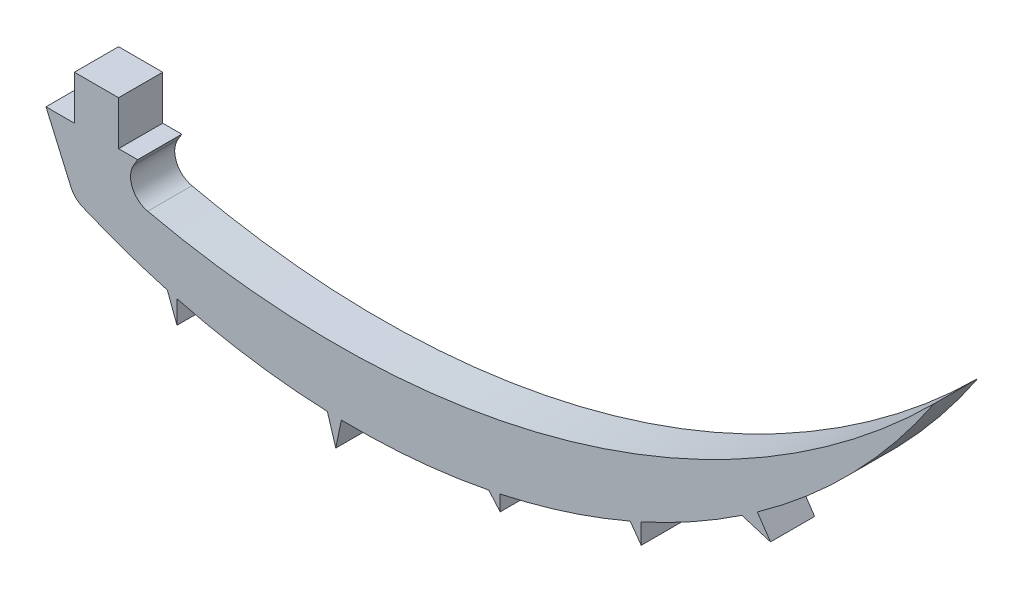
ISO-10303-21;
HEADER;
FILE_DESCRIPTION(('STEP AP214'),'2;1');
FILE_NAME('part.step','',(''),(''),'','','');
FILE_SCHEMA(('AUTOMOTIVE_DESIGN { 1 0 10303 214 1 1 1 1 }'));
ENDSEC;
DATA;
#1=APPLICATION_CONTEXT('core data for automotive mechanical design processes');
#2=APPLICATION_PROTOCOL_DEFINITION('international standard','automotive_design',2000,#1);
#3=PRODUCT_CONTEXT('',#1,'mechanical');
#4=PRODUCT('Part','Part','',(#3));
#5=PRODUCT_RELATED_PRODUCT_CATEGORY('part','',(#4));
#6=PRODUCT_DEFINITION_FORMATION('','',#4);
#7=PRODUCT_DEFINITION_CONTEXT('part definition',#1,'design');
#8=PRODUCT_DEFINITION('design','',#6,#7);
#9=PRODUCT_DEFINITION_SHAPE('','',#8);
#10=(LENGTH_UNIT() NAMED_UNIT(*) SI_UNIT(.MILLI.,.METRE.));
#11=(NAMED_UNIT(*) PLANE_ANGLE_UNIT() SI_UNIT($,.RADIAN.));
#12=(NAMED_UNIT(*) SI_UNIT($,.STERADIAN.) SOLID_ANGLE_UNIT());
#13=UNCERTAINTY_MEASURE_WITH_UNIT(LENGTH_MEASURE(1.E-05),#10,'distance_accuracy_value','');
#14=(GEOMETRIC_REPRESENTATION_CONTEXT(3) GLOBAL_UNCERTAINTY_ASSIGNED_CONTEXT((#13)) GLOBAL_UNIT_ASSIGNED_CONTEXT((#10,
#11,#12)) REPRESENTATION_CONTEXT('',''));
#15=CARTESIAN_POINT('',(0.,0.,0.));
#16=DIRECTION('',(0.,0.,1.));
#17=DIRECTION('',(1.,0.,0.));
#18=AXIS2_PLACEMENT_3D('',#15,#16,#17);
#19=CARTESIAN_POINT('',(6.43346433848039,1.52399999999999,1.524));
#20=DIRECTION('',(-1.,0.,0.));
#21=DIRECTION('',(0.,0.,1.));
#22=AXIS2_PLACEMENT_3D('',#19,#20,#21);
#23=PLANE('',#22);
#24=DIRECTION('',(0.,1.,0.));
#25=VECTOR('',#24,1.);
#26=CARTESIAN_POINT('',(6.43346433848039,1.52399999999999,0.));
#27=LINE('',#26,#25);
#28=CARTESIAN_POINT('',(6.43346433848039,0.,0.));
#29=VERTEX_POINT('',#28);
#30=CARTESIAN_POINT('',(6.43346433848039,1.52399999999999,0.));
#31=VERTEX_POINT('',#30);
#32=EDGE_CURVE('E228',#29,#31,#27,.T.);
#33=ORIENTED_EDGE('',*,*,#32,.T.);
#34=DIRECTION('',(0.,0.,-1.));
#35=VECTOR('',#34,1.);
#36=CARTESIAN_POINT('',(6.43346433848039,1.52399999999999,1.524));
#37=LINE('',#36,#35);
#38=CARTESIAN_POINT('',(6.43346433848039,1.52399999999999,1.524));
#39=VERTEX_POINT('',#38);
#40=EDGE_CURVE('E209',#39,#31,#37,.T.);
#41=ORIENTED_EDGE('',*,*,#40,.F.);
#42=DIRECTION('',(0.,1.,0.));
#43=VECTOR('',#42,1.);
#44=CARTESIAN_POINT('',(6.43346433848039,1.52399999999999,1.524));
#45=LINE('',#44,#43);
#46=CARTESIAN_POINT('',(6.43346433848039,0.,1.524));
#47=VERTEX_POINT('',#46);
#48=EDGE_CURVE('E216',#47,#39,#45,.T.);
#49=ORIENTED_EDGE('',*,*,#48,.F.);
#50=DIRECTION('',(0.,0.,-1.));
#51=VECTOR('',#50,1.);
#52=CARTESIAN_POINT('',(6.43346433848039,0.,1.524));
#53=LINE('',#52,#51);
#54=EDGE_CURVE('E301',#47,#29,#53,.T.);
#55=ORIENTED_EDGE('',*,*,#54,.T.);
#56=EDGE_LOOP('',(#33,#41,#49,#55));
#57=FACE_BOUND('',#56,.T.);
#58=ADVANCED_FACE('F32',(#57),#23,.F.);
#59=CARTESIAN_POINT('',(6.43346433848039,1.52399999999999,1.524));
#60=DIRECTION('',(0.,-1.,0.));
#61=DIRECTION('',(1.,0.,0.));
#62=AXIS2_PLACEMENT_3D('',#59,#60,#61);
#63=PLANE('',#62);
#64=DIRECTION('',(-1.,0.,0.));
#65=VECTOR('',#64,1.);
#66=CARTESIAN_POINT('',(6.43346433848039,1.52399999999999,0.));
#67=LINE('',#66,#65);
#68=CARTESIAN_POINT('',(4.90946433848039,1.52399999999999,0.));
#69=VERTEX_POINT('',#68);
#70=EDGE_CURVE('E366',#31,#69,#67,.T.);
#71=ORIENTED_EDGE('',*,*,#70,.T.);
#72=DIRECTION('',(0.,0.,-1.));
#73=VECTOR('',#72,1.);
#74=CARTESIAN_POINT('',(4.90946433848039,1.52399999999999,1.524));
#75=LINE('',#74,#73);
#76=CARTESIAN_POINT('',(4.90946433848039,1.52399999999999,1.524));
#77=VERTEX_POINT('',#76);
#78=EDGE_CURVE('E212',#77,#69,#75,.T.);
#79=ORIENTED_EDGE('',*,*,#78,.F.);
#80=DIRECTION('',(-1.,0.,0.));
#81=VECTOR('',#80,1.);
#82=CARTESIAN_POINT('',(6.43346433848039,1.52399999999999,1.524));
#83=LINE('',#82,#81);
#84=EDGE_CURVE('E205',#39,#77,#83,.T.);
#85=ORIENTED_EDGE('',*,*,#84,.F.);
#86=ORIENTED_EDGE('',*,*,#40,.T.);
#87=EDGE_LOOP('',(#71,#79,#85,#86));
#88=FACE_BOUND('',#87,.T.);
#89=ADVANCED_FACE('F207',(#88),#63,.F.);
#90=CARTESIAN_POINT('',(4.90946433848039,1.52399999999999,1.524));
#91=DIRECTION('',(1.,0.,0.));
#92=DIRECTION('',(0.,0.,-1.));
#93=AXIS2_PLACEMENT_3D('',#90,#91,#92);
#94=PLANE('',#93);
#95=DIRECTION('',(0.,-1.,0.));
#96=VECTOR('',#95,1.);
#97=CARTESIAN_POINT('',(4.90946433848039,1.52399999999999,0.));
#98=LINE('',#97,#96);
#99=CARTESIAN_POINT('',(4.90946433848039,0.,0.));
#100=VERTEX_POINT('',#99);
#101=EDGE_CURVE('E365',#69,#100,#98,.T.);
#102=ORIENTED_EDGE('',*,*,#101,.T.);
#103=DIRECTION('',(0.,0.,-1.));
#104=VECTOR('',#103,1.);
#105=CARTESIAN_POINT('',(4.90946433848039,0.,1.524));
#106=LINE('',#105,#104);
#107=CARTESIAN_POINT('',(4.90946433848039,0.,1.524));
#108=VERTEX_POINT('',#107);
#109=EDGE_CURVE('E234',#108,#100,#106,.T.);
#110=ORIENTED_EDGE('',*,*,#109,.F.);
#111=DIRECTION('',(0.,-1.,0.));
#112=VECTOR('',#111,1.);
#113=CARTESIAN_POINT('',(4.90946433848039,1.52399999999999,1.524));
#114=LINE('',#113,#112);
#115=EDGE_CURVE('E215',#77,#108,#114,.T.);
#116=ORIENTED_EDGE('',*,*,#115,.F.);
#117=ORIENTED_EDGE('',*,*,#78,.T.);
#118=EDGE_LOOP('',(#102,#110,#116,#117));
#119=FACE_BOUND('',#118,.T.);
#120=ADVANCED_FACE('F411',(#119),#94,.F.);
#121=CARTESIAN_POINT('',(4.90946433848039,0.,1.524));
#122=DIRECTION('',(0.,-1.,0.));
#123=DIRECTION('',(0.,0.,-1.));
#124=AXIS2_PLACEMENT_3D('',#121,#122,#123);
#125=PLANE('',#124);
#126=DIRECTION('',(-1.,0.,0.));
#127=VECTOR('',#126,1.);
#128=CARTESIAN_POINT('',(4.90946433848039,0.,0.));
#129=LINE('',#128,#127);
#130=CARTESIAN_POINT('',(3.92977917550752,0.,0.));
#131=VERTEX_POINT('',#130);
#132=EDGE_CURVE('E264',#100,#131,#129,.T.);
#133=ORIENTED_EDGE('',*,*,#132,.T.);
#134=DIRECTION('',(0.,0.,-1.));
#135=VECTOR('',#134,1.);
#136=CARTESIAN_POINT('',(3.92977917550752,0.,1.524));
#137=LINE('',#136,#135);
#138=CARTESIAN_POINT('',(3.92977917550752,0.,1.524));
#139=VERTEX_POINT('',#138);
#140=EDGE_CURVE('E353',#139,#131,#137,.T.);
#141=ORIENTED_EDGE('',*,*,#140,.F.);
#142=DIRECTION('',(-1.,0.,0.));
#143=VECTOR('',#142,1.);
#144=CARTESIAN_POINT('',(4.90946433848039,0.,1.524));
#145=LINE('',#144,#143);
#146=EDGE_CURVE('E362',#108,#139,#145,.T.);
#147=ORIENTED_EDGE('',*,*,#146,.F.);
#148=ORIENTED_EDGE('',*,*,#109,.T.);
#149=EDGE_LOOP('',(#133,#141,#147,#148));
#150=FACE_BOUND('',#149,.T.);
#151=ADVANCED_FACE('F360',(#150),#125,.F.);
#152=CARTESIAN_POINT('',(3.92977917550752,0.,1.524));
#153=DIRECTION('',(0.916259801458059,0.40058454317664,0.));
#154=DIRECTION('',(-0.40058454317664,0.916259801458059,0.));
#155=AXIS2_PLACEMENT_3D('',#152,#153,#154);
#156=PLANE('',#155);
#157=DIRECTION('',(0.40058454317664,-0.916259801458059,0.));
#158=VECTOR('',#157,1.);
#159=CARTESIAN_POINT('',(3.92977917550752,0.,0.));
#160=LINE('',#159,#158);
#161=CARTESIAN_POINT('',(4.78910473775959,-1.96554131323465,0.));
#162=VERTEX_POINT('',#161);
#163=EDGE_CURVE('E260',#131,#162,#160,.T.);
#164=ORIENTED_EDGE('',*,*,#163,.T.);
#165=DIRECTION('',(0.,0.,-1.));
#166=VECTOR('',#165,1.);
#167=CARTESIAN_POINT('',(4.78910473775959,-1.96554131323465,1.524));
#168=LINE('',#167,#166);
#169=CARTESIAN_POINT('',(4.78910473775959,-1.96554131323465,1.524));
#170=VERTEX_POINT('',#169);
#171=EDGE_CURVE('E40',#162,#170,#168,.F.);
#172=ORIENTED_EDGE('',*,*,#171,.T.);
#173=DIRECTION('',(0.40058454317664,-0.916259801458059,0.));
#174=VECTOR('',#173,1.);
#175=CARTESIAN_POINT('',(3.92977917550752,0.,1.524));
#176=LINE('',#175,#174);
#177=EDGE_CURVE('E408',#139,#170,#176,.T.);
#178=ORIENTED_EDGE('',*,*,#177,.F.);
#179=ORIENTED_EDGE('',*,*,#140,.T.);
#180=EDGE_LOOP('',(#164,#172,#178,#179));
#181=FACE_BOUND('',#180,.T.);
#182=ADVANCED_FACE('F418',(#181),#156,.F.);
#183=CARTESIAN_POINT('',(14.5688330316218,19.7561173000562,1.524));
#184=DIRECTION('',(0.,0.,-1.));
#185=DIRECTION('',(-1.,0.,0.));
#186=AXIS2_PLACEMENT_3D('',#183,#184,#185);
#187=CYLINDRICAL_SURFACE('',#186,24.0243535424845);
#188=CARTESIAN_POINT('',(14.5688330316218,19.7561173000562,1.524));
#189=DIRECTION('',(0.,0.,1.));
#190=DIRECTION('',(-1.,0.,0.));
#191=AXIS2_PLACEMENT_3D('',#188,#189,#190);
#192=CIRCLE('',#191,24.0243535424845);
#193=CARTESIAN_POINT('',(5.18981267434835,-2.36182881327314,1.524));
#194=VERTEX_POINT('',#193);
#195=CARTESIAN_POINT('',(8.11709991123755,-3.38572149632355,1.524));
#196=VERTEX_POINT('',#195);
#197=EDGE_CURVE('E253',#194,#196,#192,.T.);
#198=ORIENTED_EDGE('',*,*,#197,.F.);
#199=DIRECTION('',(0.,0.,-1.));
#200=VECTOR('',#199,1.);
#201=CARTESIAN_POINT('',(5.18981267434835,-2.36182881327314,1.524));
#202=LINE('',#201,#200);
#203=CARTESIAN_POINT('',(5.18981267434835,-2.36182881327314,0.));
#204=VERTEX_POINT('',#203);
#205=EDGE_CURVE('E243',#194,#204,#202,.T.);
#206=ORIENTED_EDGE('',*,*,#205,.T.);
#207=CARTESIAN_POINT('',(14.5688330316218,19.7561173000562,0.));
#208=DIRECTION('',(0.,0.,1.));
#209=DIRECTION('',(-1.,0.,0.));
#210=AXIS2_PLACEMENT_3D('',#207,#208,#209);
#211=CIRCLE('',#210,24.0243535424845);
#212=CARTESIAN_POINT('',(8.11709991123755,-3.38572149632355,0.));
#213=VERTEX_POINT('',#212);
#214=EDGE_CURVE('E251',#204,#213,#211,.T.);
#215=ORIENTED_EDGE('',*,*,#214,.T.);
#216=DIRECTION('',(0.,0.,-1.));
#217=VECTOR('',#216,1.);
#218=CARTESIAN_POINT('',(8.11709991123755,-3.38572149632355,1.524));
#219=LINE('',#218,#217);
#220=EDGE_CURVE('E351',#196,#213,#219,.T.);
#221=ORIENTED_EDGE('',*,*,#220,.F.);
#222=EDGE_LOOP('',(#198,#206,#215,#221));
#223=FACE_BOUND('',#222,.T.);
#224=ADVANCED_FACE('F249',(#223),#187,.T.);
#225=CARTESIAN_POINT('',(8.11709991123753,-3.38572149632354,1.524));
#226=DIRECTION('',(0.935666460990352,0.352885638384151,0.));
#227=DIRECTION('',(-0.352885638384151,0.935666460990352,0.));
#228=AXIS2_PLACEMENT_3D('',#225,#226,#227);
#229=PLANE('',#228);
#230=DIRECTION('',(0.352885638384151,-0.935666460990352,0.));
#231=VECTOR('',#230,1.);
#232=CARTESIAN_POINT('',(8.11709991123753,-3.38572149632354,0.));
#233=LINE('',#232,#231);
#234=CARTESIAN_POINT('',(8.44993943530575,-4.26823624242835,0.));
#235=VERTEX_POINT('',#234);
#236=EDGE_CURVE('E259',#213,#235,#233,.T.);
#237=ORIENTED_EDGE('',*,*,#236,.T.);
#238=DIRECTION('',(0.,0.,-1.));
#239=VECTOR('',#238,1.);
#240=CARTESIAN_POINT('',(8.44993943530575,-4.26823624242835,1.524));
#241=LINE('',#240,#239);
#242=CARTESIAN_POINT('',(8.44993943530575,-4.26823624242835,1.524));
#243=VERTEX_POINT('',#242);
#244=EDGE_CURVE('E348',#243,#235,#241,.T.);
#245=ORIENTED_EDGE('',*,*,#244,.F.);
#246=DIRECTION('',(0.352885638384151,-0.935666460990352,0.));
#247=VECTOR('',#246,1.);
#248=CARTESIAN_POINT('',(8.11709991123753,-3.38572149632354,1.524));
#249=LINE('',#248,#247);
#250=EDGE_CURVE('E405',#196,#243,#249,.T.);
#251=ORIENTED_EDGE('',*,*,#250,.F.);
#252=ORIENTED_EDGE('',*,*,#220,.T.);
#253=EDGE_LOOP('',(#237,#245,#251,#252));
#254=FACE_BOUND('',#253,.T.);
#255=ADVANCED_FACE('F520',(#254),#229,.F.);
#256=CARTESIAN_POINT('',(8.44993943530575,-4.26823624242835,1.524));
#257=DIRECTION('',(-1.,0.,0.));
#258=DIRECTION('',(0.,0.,1.));
#259=AXIS2_PLACEMENT_3D('',#256,#257,#258);
#260=PLANE('',#259);
#261=DIRECTION('',(0.,1.,0.));
#262=VECTOR('',#261,1.);
#263=CARTESIAN_POINT('',(8.44993943530575,-4.26823624242835,0.));
#264=LINE('',#263,#262);
#265=CARTESIAN_POINT('',(8.44993943530575,-3.47594468960052,0.));
#266=VERTEX_POINT('',#265);
#267=EDGE_CURVE('E262',#235,#266,#264,.T.);
#268=ORIENTED_EDGE('',*,*,#267,.T.);
#269=DIRECTION('',(0.,0.,-1.));
#270=VECTOR('',#269,1.);
#271=CARTESIAN_POINT('',(8.44993943530575,-3.47594468960052,1.524));
#272=LINE('',#271,#270);
#273=CARTESIAN_POINT('',(8.44993943530575,-3.47594468960052,1.524));
#274=VERTEX_POINT('',#273);
#275=EDGE_CURVE('E345',#274,#266,#272,.T.);
#276=ORIENTED_EDGE('',*,*,#275,.F.);
#277=DIRECTION('',(0.,1.,0.));
#278=VECTOR('',#277,1.);
#279=CARTESIAN_POINT('',(8.44993943530575,-4.26823624242835,1.524));
#280=LINE('',#279,#278);
#281=EDGE_CURVE('E403',#243,#274,#280,.T.);
#282=ORIENTED_EDGE('',*,*,#281,.F.);
#283=ORIENTED_EDGE('',*,*,#244,.T.);
#284=EDGE_LOOP('',(#268,#276,#282,#283));
#285=FACE_BOUND('',#284,.T.);
#286=ADVANCED_FACE('F515',(#285),#260,.F.);
#287=CARTESIAN_POINT('',(14.5688330316218,19.7561173000562,1.524));
#288=DIRECTION('',(0.,0.,-1.));
#289=DIRECTION('',(-1.,0.,0.));
#290=AXIS2_PLACEMENT_3D('',#287,#288,#289);
#291=CYLINDRICAL_SURFACE('',#290,24.0243535424845);
#292=CARTESIAN_POINT('',(14.5688330316218,19.7561173000562,0.));
#293=DIRECTION('',(0.,0.,1.));
#294=DIRECTION('',(-1.,0.,0.));
#295=AXIS2_PLACEMENT_3D('',#292,#293,#294);
#296=CIRCLE('',#295,24.0243535424845);
#297=CARTESIAN_POINT('',(13.6386151081454,-4.25022056620597,0.));
#298=VERTEX_POINT('',#297);
#299=EDGE_CURVE('E269',#266,#298,#296,.T.);
#300=ORIENTED_EDGE('',*,*,#299,.T.);
#301=DIRECTION('',(0.,0.,-1.));
#302=VECTOR('',#301,1.);
#303=CARTESIAN_POINT('',(13.6386151081454,-4.25022056620597,1.524));
#304=LINE('',#303,#302);
#305=CARTESIAN_POINT('',(13.6386151081454,-4.25022056620597,1.524));
#306=VERTEX_POINT('',#305);
#307=EDGE_CURVE('E342',#306,#298,#304,.T.);
#308=ORIENTED_EDGE('',*,*,#307,.F.);
#309=CARTESIAN_POINT('',(14.5688330316218,19.7561173000562,1.524));
#310=DIRECTION('',(0.,0.,1.));
#311=DIRECTION('',(-1.,0.,0.));
#312=AXIS2_PLACEMENT_3D('',#309,#310,#311);
#313=CIRCLE('',#312,24.0243535424845);
#314=EDGE_CURVE('E401',#274,#306,#313,.T.);
#315=ORIENTED_EDGE('',*,*,#314,.F.);
#316=ORIENTED_EDGE('',*,*,#275,.T.);
#317=EDGE_LOOP('',(#300,#308,#315,#316));
#318=FACE_BOUND('',#317,.T.);
#319=ADVANCED_FACE('F512',(#318),#291,.T.);
#320=CARTESIAN_POINT('',(13.6386151081453,-4.25022056620597,1.524));
#321=DIRECTION('',(0.956588469923752,0.291442102670386,0.));
#322=DIRECTION('',(-0.291442102670386,0.956588469923752,0.));
#323=AXIS2_PLACEMENT_3D('',#320,#321,#322);
#324=PLANE('',#323);
#325=DIRECTION('',(0.291442102670386,-0.956588469923752,0.));
#326=VECTOR('',#325,1.);
#327=CARTESIAN_POINT('',(13.6386151081453,-4.25022056620597,0.));
#328=LINE('',#327,#326);
#329=CARTESIAN_POINT('',(13.9280330022667,-5.2001650593638,0.));
#330=VERTEX_POINT('',#329);
#331=EDGE_CURVE('E271',#298,#330,#328,.T.);
#332=ORIENTED_EDGE('',*,*,#331,.T.);
#333=DIRECTION('',(0.,0.,-1.));
#334=VECTOR('',#333,1.);
#335=CARTESIAN_POINT('',(13.9280330022667,-5.2001650593638,1.524));
#336=LINE('',#335,#334);
#337=CARTESIAN_POINT('',(13.9280330022667,-5.2001650593638,1.524));
#338=VERTEX_POINT('',#337);
#339=EDGE_CURVE('E339',#338,#330,#336,.T.);
#340=ORIENTED_EDGE('',*,*,#339,.F.);
#341=DIRECTION('',(0.291442102670386,-0.956588469923752,0.));
#342=VECTOR('',#341,1.);
#343=CARTESIAN_POINT('',(13.6386151081453,-4.25022056620597,1.524));
#344=LINE('',#343,#342);
#345=EDGE_CURVE('E399',#306,#338,#344,.T.);
#346=ORIENTED_EDGE('',*,*,#345,.F.);
#347=ORIENTED_EDGE('',*,*,#307,.T.);
#348=EDGE_LOOP('',(#332,#340,#346,#347));
#349=FACE_BOUND('',#348,.T.);
#350=ADVANCED_FACE('F508',(#349),#324,.F.);
#351=CARTESIAN_POINT('',(13.9280330022667,-5.2001650593638,1.524));
#352=DIRECTION('',(-0.979248150632492,0.202664894549707,0.));
#353=DIRECTION('',(-0.202664894549707,-0.979248150632492,0.));
#354=AXIS2_PLACEMENT_3D('',#351,#352,#353);
#355=PLANE('',#354);
#356=DIRECTION('',(0.202664894549707,0.979248150632492,0.));
#357=VECTOR('',#356,1.);
#358=CARTESIAN_POINT('',(13.9280330022667,-5.2001650593638,0.));
#359=LINE('',#358,#357);
#360=CARTESIAN_POINT('',(14.1217656712951,-4.26407616106355,0.));
#361=VERTEX_POINT('',#360);
#362=EDGE_CURVE('E273',#330,#361,#359,.T.);
#363=ORIENTED_EDGE('',*,*,#362,.T.);
#364=DIRECTION('',(0.,0.,-1.));
#365=VECTOR('',#364,1.);
#366=CARTESIAN_POINT('',(14.1217656712951,-4.26407616106355,1.524));
#367=LINE('',#366,#365);
#368=CARTESIAN_POINT('',(14.1217656712951,-4.26407616106355,1.524));
#369=VERTEX_POINT('',#368);
#370=EDGE_CURVE('E336',#369,#361,#367,.T.);
#371=ORIENTED_EDGE('',*,*,#370,.F.);
#372=DIRECTION('',(0.202664894549707,0.979248150632492,0.));
#373=VECTOR('',#372,1.);
#374=CARTESIAN_POINT('',(13.9280330022667,-5.2001650593638,1.524));
#375=LINE('',#374,#373);
#376=EDGE_CURVE('E397',#338,#369,#375,.T.);
#377=ORIENTED_EDGE('',*,*,#376,.F.);
#378=ORIENTED_EDGE('',*,*,#339,.T.);
#379=EDGE_LOOP('',(#363,#371,#377,#378));
#380=FACE_BOUND('',#379,.T.);
#381=ADVANCED_FACE('F503',(#380),#355,.F.);
#382=CARTESIAN_POINT('',(14.5688330316218,19.7561173000562,1.524));
#383=DIRECTION('',(0.,0.,-1.));
#384=DIRECTION('',(-1.,0.,0.));
#385=AXIS2_PLACEMENT_3D('',#382,#383,#384);
#386=CYLINDRICAL_SURFACE('',#385,24.0243535424845);
#387=CARTESIAN_POINT('',(14.5688330316218,19.7561173000562,0.));
#388=DIRECTION('',(0.,0.,1.));
#389=DIRECTION('',(-1.,0.,0.));
#390=AXIS2_PLACEMENT_3D('',#387,#388,#389);
#391=CIRCLE('',#390,24.0243535424845);
#392=CARTESIAN_POINT('',(19.2073154163076,-3.81619790870615,0.));
#393=VERTEX_POINT('',#392);
#394=EDGE_CURVE('E275',#361,#393,#391,.T.);
#395=ORIENTED_EDGE('',*,*,#394,.T.);
#396=DIRECTION('',(0.,0.,-1.));
#397=VECTOR('',#396,1.);
#398=CARTESIAN_POINT('',(19.2073154163076,-3.81619790870615,1.524));
#399=LINE('',#398,#397);
#400=CARTESIAN_POINT('',(19.2073154163076,-3.81619790870615,1.524));
#401=VERTEX_POINT('',#400);
#402=EDGE_CURVE('E333',#401,#393,#399,.T.);
#403=ORIENTED_EDGE('',*,*,#402,.F.);
#404=CARTESIAN_POINT('',(14.5688330316218,19.7561173000562,1.524));
#405=DIRECTION('',(0.,0.,1.));
#406=DIRECTION('',(-1.,0.,0.));
#407=AXIS2_PLACEMENT_3D('',#404,#405,#406);
#408=CIRCLE('',#407,24.0243535424845);
#409=EDGE_CURVE('E395',#369,#401,#408,.T.);
#410=ORIENTED_EDGE('',*,*,#409,.F.);
#411=ORIENTED_EDGE('',*,*,#370,.T.);
#412=EDGE_LOOP('',(#395,#403,#410,#411));
#413=FACE_BOUND('',#412,.T.);
#414=ADVANCED_FACE('F497',(#413),#386,.T.);
#415=CARTESIAN_POINT('',(19.2073154163076,-3.81619790870615,1.524));
#416=DIRECTION('',(0.753207680802926,0.657782782975868,0.));
#417=DIRECTION('',(-0.657782782975868,0.753207680802926,0.));
#418=AXIS2_PLACEMENT_3D('',#415,#416,#417);
#419=PLANE('',#418);
#420=DIRECTION('',(0.657782782975868,-0.753207680802926,0.));
#421=VECTOR('',#420,1.);
#422=CARTESIAN_POINT('',(19.2073154163076,-3.81619790870615,0.));
#423=LINE('',#422,#421);
#424=CARTESIAN_POINT('',(19.6020844033294,-4.26823624242835,0.));
#425=VERTEX_POINT('',#424);
#426=EDGE_CURVE('E277',#393,#425,#423,.T.);
#427=ORIENTED_EDGE('',*,*,#426,.T.);
#428=DIRECTION('',(0.,0.,-1.));
#429=VECTOR('',#428,1.);
#430=CARTESIAN_POINT('',(19.6020844033294,-4.26823624242835,1.524));
#431=LINE('',#430,#429);
#432=CARTESIAN_POINT('',(19.6020844033294,-4.26823624242835,1.524));
#433=VERTEX_POINT('',#432);
#434=EDGE_CURVE('E330',#433,#425,#431,.T.);
#435=ORIENTED_EDGE('',*,*,#434,.F.);
#436=DIRECTION('',(0.657782782975868,-0.753207680802926,0.));
#437=VECTOR('',#436,1.);
#438=CARTESIAN_POINT('',(19.2073154163076,-3.81619790870615,1.524));
#439=LINE('',#438,#437);
#440=EDGE_CURVE('E393',#401,#433,#439,.T.);
#441=ORIENTED_EDGE('',*,*,#440,.F.);
#442=ORIENTED_EDGE('',*,*,#402,.T.);
#443=EDGE_LOOP('',(#427,#435,#441,#442));
#444=FACE_BOUND('',#443,.T.);
#445=ADVANCED_FACE('F493',(#444),#419,.F.);
#446=CARTESIAN_POINT('',(19.6020844033294,-4.26823624242835,1.524));
#447=DIRECTION('',(-1.,0.,0.));
#448=DIRECTION('',(0.,0.,1.));
#449=AXIS2_PLACEMENT_3D('',#446,#447,#448);
#450=PLANE('',#449);
#451=DIRECTION('',(0.,1.,0.));
#452=VECTOR('',#451,1.);
#453=CARTESIAN_POINT('',(19.6020844033294,-4.26823624242835,0.));
#454=LINE('',#453,#452);
#455=CARTESIAN_POINT('',(19.6020844033294,-3.73507134086815,0.));
#456=VERTEX_POINT('',#455);
#457=EDGE_CURVE('E279',#425,#456,#454,.T.);
#458=ORIENTED_EDGE('',*,*,#457,.T.);
#459=DIRECTION('',(0.,0.,-1.));
#460=VECTOR('',#459,1.);
#461=CARTESIAN_POINT('',(19.6020844033294,-3.73507134086815,1.524));
#462=LINE('',#461,#460);
#463=CARTESIAN_POINT('',(19.6020844033294,-3.73507134086815,1.524));
#464=VERTEX_POINT('',#463);
#465=EDGE_CURVE('E327',#464,#456,#462,.T.);
#466=ORIENTED_EDGE('',*,*,#465,.F.);
#467=DIRECTION('',(0.,1.,0.));
#468=VECTOR('',#467,1.);
#469=CARTESIAN_POINT('',(19.6020844033294,-4.26823624242835,1.524));
#470=LINE('',#469,#468);
#471=EDGE_CURVE('E391',#433,#464,#470,.T.);
#472=ORIENTED_EDGE('',*,*,#471,.F.);
#473=ORIENTED_EDGE('',*,*,#434,.T.);
#474=EDGE_LOOP('',(#458,#466,#472,#473));
#475=FACE_BOUND('',#474,.T.);
#476=ADVANCED_FACE('F488',(#475),#450,.F.);
#477=CARTESIAN_POINT('',(14.5688330316218,19.7561173000562,1.524));
#478=DIRECTION('',(0.,0.,-1.));
#479=DIRECTION('',(-1.,0.,0.));
#480=AXIS2_PLACEMENT_3D('',#477,#478,#479);
#481=CYLINDRICAL_SURFACE('',#480,24.0243535424845);
#482=CARTESIAN_POINT('',(14.5688330316218,19.7561173000562,0.));
#483=DIRECTION('',(0.,0.,1.));
#484=DIRECTION('',(-1.,0.,0.));
#485=AXIS2_PLACEMENT_3D('',#482,#483,#484);
#486=CIRCLE('',#485,24.0243535424845);
#487=CARTESIAN_POINT('',(24.0861747155863,-2.30266259378566,0.));
#488=VERTEX_POINT('',#487);
#489=EDGE_CURVE('E281',#456,#488,#486,.T.);
#490=ORIENTED_EDGE('',*,*,#489,.T.);
#491=DIRECTION('',(0.,0.,-1.));
#492=VECTOR('',#491,1.);
#493=CARTESIAN_POINT('',(24.0861747155863,-2.30266259378566,1.524));
#494=LINE('',#493,#492);
#495=CARTESIAN_POINT('',(24.0861747155863,-2.30266259378566,1.524));
#496=VERTEX_POINT('',#495);
#497=EDGE_CURVE('E324',#496,#488,#494,.T.);
#498=ORIENTED_EDGE('',*,*,#497,.F.);
#499=CARTESIAN_POINT('',(14.5688330316218,19.7561173000562,1.524));
#500=DIRECTION('',(0.,0.,1.));
#501=DIRECTION('',(-1.,0.,0.));
#502=AXIS2_PLACEMENT_3D('',#499,#500,#501);
#503=CIRCLE('',#502,24.0243535424845);
#504=EDGE_CURVE('E389',#464,#496,#503,.T.);
#505=ORIENTED_EDGE('',*,*,#504,.F.);
#506=ORIENTED_EDGE('',*,*,#465,.T.);
#507=EDGE_LOOP('',(#490,#498,#505,#506));
#508=FACE_BOUND('',#507,.T.);
#509=ADVANCED_FACE('F482',(#508),#481,.T.);
#510=CARTESIAN_POINT('',(24.0861747155863,-2.30266259378566,1.524));
#511=DIRECTION('',(0.812015371342709,0.583636048152582,0.));
#512=DIRECTION('',(-0.583636048152582,0.812015371342709,0.));
#513=AXIS2_PLACEMENT_3D('',#510,#511,#512);
#514=PLANE('',#513);
#515=DIRECTION('',(0.583636048152582,-0.812015371342709,0.));
#516=VECTOR('',#515,1.);
#517=CARTESIAN_POINT('',(24.0861747155863,-2.30266259378566,0.));
#518=LINE('',#517,#516);
#519=CARTESIAN_POINT('',(24.4684749348306,-2.83455855099515,0.));
#520=VERTEX_POINT('',#519);
#521=EDGE_CURVE('E283',#488,#520,#518,.T.);
#522=ORIENTED_EDGE('',*,*,#521,.T.);
#523=DIRECTION('',(0.,0.,-1.));
#524=VECTOR('',#523,1.);
#525=CARTESIAN_POINT('',(24.4684749348306,-2.83455855099515,1.524));
#526=LINE('',#525,#524);
#527=CARTESIAN_POINT('',(24.4684749348306,-2.83455855099515,1.524));
#528=VERTEX_POINT('',#527);
#529=EDGE_CURVE('E321',#528,#520,#526,.T.);
#530=ORIENTED_EDGE('',*,*,#529,.F.);
#531=DIRECTION('',(0.583636048152582,-0.812015371342709,0.));
#532=VECTOR('',#531,1.);
#533=CARTESIAN_POINT('',(24.0861747155863,-2.30266259378566,1.524));
#534=LINE('',#533,#532);
#535=EDGE_CURVE('E387',#496,#528,#534,.T.);
#536=ORIENTED_EDGE('',*,*,#535,.F.);
#537=ORIENTED_EDGE('',*,*,#497,.T.);
#538=EDGE_LOOP('',(#522,#530,#536,#537));
#539=FACE_BOUND('',#538,.T.);
#540=ADVANCED_FACE('F478',(#539),#514,.F.);
#541=CARTESIAN_POINT('',(24.4684749348306,-2.83455855099515,1.524));
#542=DIRECTION('',(-1.,0.,0.));
#543=DIRECTION('',(0.,0.,1.));
#544=AXIS2_PLACEMENT_3D('',#541,#542,#543);
#545=PLANE('',#544);
#546=DIRECTION('',(0.,1.,0.));
#547=VECTOR('',#546,1.);
#548=CARTESIAN_POINT('',(24.4684749348306,-2.83455855099515,0.));
#549=LINE('',#548,#547);
#550=CARTESIAN_POINT('',(24.4684749348306,-2.13375828941488,0.));
#551=VERTEX_POINT('',#550);
#552=EDGE_CURVE('E285',#520,#551,#549,.T.);
#553=ORIENTED_EDGE('',*,*,#552,.T.);
#554=DIRECTION('',(0.,0.,-1.));
#555=VECTOR('',#554,1.);
#556=CARTESIAN_POINT('',(24.4684749348306,-2.13375828941488,1.524));
#557=LINE('',#556,#555);
#558=CARTESIAN_POINT('',(24.4684749348306,-2.13375828941488,1.524));
#559=VERTEX_POINT('',#558);
#560=EDGE_CURVE('E318',#559,#551,#557,.T.);
#561=ORIENTED_EDGE('',*,*,#560,.F.);
#562=DIRECTION('',(0.,1.,0.));
#563=VECTOR('',#562,1.);
#564=CARTESIAN_POINT('',(24.4684749348306,-2.83455855099515,1.524));
#565=LINE('',#564,#563);
#566=EDGE_CURVE('E385',#528,#559,#565,.T.);
#567=ORIENTED_EDGE('',*,*,#566,.F.);
#568=ORIENTED_EDGE('',*,*,#529,.T.);
#569=EDGE_LOOP('',(#553,#561,#567,#568));
#570=FACE_BOUND('',#569,.T.);
#571=ADVANCED_FACE('F473',(#570),#545,.F.);
#572=CARTESIAN_POINT('',(14.5688330316218,19.7561173000562,1.524));
#573=DIRECTION('',(0.,0.,-1.));
#574=DIRECTION('',(-1.,0.,0.));
#575=AXIS2_PLACEMENT_3D('',#572,#573,#574);
#576=CYLINDRICAL_SURFACE('',#575,24.0243535424845);
#577=CARTESIAN_POINT('',(14.5688330316218,19.7561173000562,0.));
#578=DIRECTION('',(0.,0.,1.));
#579=DIRECTION('',(-1.,0.,0.));
#580=AXIS2_PLACEMENT_3D('',#577,#578,#579);
#581=CIRCLE('',#580,24.0243535424845);
#582=CARTESIAN_POINT('',(27.9410248811519,-0.202691488888324,0.));
#583=VERTEX_POINT('',#582);
#584=EDGE_CURVE('E287',#551,#583,#581,.T.);
#585=ORIENTED_EDGE('',*,*,#584,.T.);
#586=DIRECTION('',(0.,0.,-1.));
#587=VECTOR('',#586,1.);
#588=CARTESIAN_POINT('',(27.9410248811519,-0.202691488888324,1.524));
#589=LINE('',#588,#587);
#590=CARTESIAN_POINT('',(27.9410248811519,-0.202691488888324,1.524));
#591=VERTEX_POINT('',#590);
#592=EDGE_CURVE('E315',#591,#583,#589,.T.);
#593=ORIENTED_EDGE('',*,*,#592,.F.);
#594=CARTESIAN_POINT('',(14.5688330316218,19.7561173000562,1.524));
#595=DIRECTION('',(0.,0.,1.));
#596=DIRECTION('',(-1.,0.,0.));
#597=AXIS2_PLACEMENT_3D('',#594,#595,#596);
#598=CIRCLE('',#597,24.0243535424845);
#599=EDGE_CURVE('E383',#559,#591,#598,.T.);
#600=ORIENTED_EDGE('',*,*,#599,.F.);
#601=ORIENTED_EDGE('',*,*,#560,.T.);
#602=EDGE_LOOP('',(#585,#593,#600,#601));
#603=FACE_BOUND('',#602,.T.);
#604=ADVANCED_FACE('F467',(#603),#576,.T.);
#605=CARTESIAN_POINT('',(27.9410248811519,-0.202691488888324,1.524));
#606=DIRECTION('',(0.290510723637589,0.956871736154624,0.));
#607=DIRECTION('',(-0.956871736154624,0.290510723637589,0.));
#608=AXIS2_PLACEMENT_3D('',#605,#606,#607);
#609=PLANE('',#608);
#610=DIRECTION('',(0.956871736154624,-0.290510723637589,0.));
#611=VECTOR('',#610,1.);
#612=CARTESIAN_POINT('',(27.9410248811519,-0.202691488888324,0.));
#613=LINE('',#612,#611);
#614=CARTESIAN_POINT('',(28.92933292204,-0.502746421317485,0.));
#615=VERTEX_POINT('',#614);
#616=EDGE_CURVE('E289',#583,#615,#613,.T.);
#617=ORIENTED_EDGE('',*,*,#616,.T.);
#618=DIRECTION('',(0.,0.,-1.));
#619=VECTOR('',#618,1.);
#620=CARTESIAN_POINT('',(28.92933292204,-0.502746421317485,1.524));
#621=LINE('',#620,#619);
#622=CARTESIAN_POINT('',(28.92933292204,-0.502746421317485,1.524));
#623=VERTEX_POINT('',#622);
#624=EDGE_CURVE('E312',#623,#615,#621,.T.);
#625=ORIENTED_EDGE('',*,*,#624,.F.);
#626=DIRECTION('',(0.956871736154624,-0.290510723637589,0.));
#627=VECTOR('',#626,1.);
#628=CARTESIAN_POINT('',(27.9410248811519,-0.202691488888324,1.524));
#629=LINE('',#628,#627);
#630=EDGE_CURVE('E381',#591,#623,#629,.T.);
#631=ORIENTED_EDGE('',*,*,#630,.F.);
#632=ORIENTED_EDGE('',*,*,#592,.T.);
#633=EDGE_LOOP('',(#617,#625,#631,#632));
#634=FACE_BOUND('',#633,.T.);
#635=ADVANCED_FACE('F463',(#634),#609,.F.);
#636=CARTESIAN_POINT('',(28.92933292204,-0.502746421317485,1.524));
#637=DIRECTION('',(-0.826712879960879,-0.562624043306708,0.));
#638=DIRECTION('',(0.562624043306708,-0.82671287996088,0.));
#639=AXIS2_PLACEMENT_3D('',#636,#637,#638);
#640=PLANE('',#639);
#641=DIRECTION('',(-0.562624043306708,0.82671287996088,0.));
#642=VECTOR('',#641,1.);
#643=CARTESIAN_POINT('',(28.92933292204,-0.502746421317485,0.));
#644=LINE('',#643,#642);
#645=CARTESIAN_POINT('',(28.4746501241104,0.16535891441579,0.));
#646=VERTEX_POINT('',#645);
#647=EDGE_CURVE('E291',#615,#646,#644,.T.);
#648=ORIENTED_EDGE('',*,*,#647,.T.);
#649=DIRECTION('',(0.,0.,-1.));
#650=VECTOR('',#649,1.);
#651=CARTESIAN_POINT('',(28.4746501241104,0.16535891441579,1.524));
#652=LINE('',#651,#650);
#653=CARTESIAN_POINT('',(28.4746501241104,0.16535891441579,1.524));
#654=VERTEX_POINT('',#653);
#655=EDGE_CURVE('E309',#654,#646,#652,.T.);
#656=ORIENTED_EDGE('',*,*,#655,.F.);
#657=DIRECTION('',(-0.562624043306708,0.82671287996088,0.));
#658=VECTOR('',#657,1.);
#659=CARTESIAN_POINT('',(28.92933292204,-0.502746421317485,1.524));
#660=LINE('',#659,#658);
#661=EDGE_CURVE('E379',#623,#654,#660,.T.);
#662=ORIENTED_EDGE('',*,*,#661,.F.);
#663=ORIENTED_EDGE('',*,*,#624,.T.);
#664=EDGE_LOOP('',(#648,#656,#662,#663));
#665=FACE_BOUND('',#664,.T.);
#666=ADVANCED_FACE('F458',(#665),#640,.F.);
#667=CARTESIAN_POINT('',(14.5688330316218,19.7561173000562,1.524));
#668=DIRECTION('',(0.,0.,-1.));
#669=DIRECTION('',(-1.,0.,0.));
#670=AXIS2_PLACEMENT_3D('',#667,#668,#669);
#671=CYLINDRICAL_SURFACE('',#670,24.0243535424845);
#672=CARTESIAN_POINT('',(14.5688330316218,19.7561173000562,0.));
#673=DIRECTION('',(0.,0.,1.));
#674=DIRECTION('',(-1.,0.,0.));
#675=AXIS2_PLACEMENT_3D('',#672,#673,#674);
#676=CIRCLE('',#675,24.0243535424845);
#677=CARTESIAN_POINT('',(34.5647076786406,6.43941499674557,0.));
#678=VERTEX_POINT('',#677);
#679=EDGE_CURVE('E293',#646,#678,#676,.T.);
#680=ORIENTED_EDGE('',*,*,#679,.T.);
#681=DIRECTION('',(0.,0.,-1.));
#682=VECTOR('',#681,1.);
#683=CARTESIAN_POINT('',(34.5647076786406,6.43941499674557,1.524));
#684=LINE('',#683,#682);
#685=CARTESIAN_POINT('',(34.5647076786406,6.43941499674557,1.524));
#686=VERTEX_POINT('',#685);
#687=EDGE_CURVE('E306',#686,#678,#684,.T.);
#688=ORIENTED_EDGE('',*,*,#687,.F.);
#689=CARTESIAN_POINT('',(14.5688330316218,19.7561173000562,1.524));
#690=DIRECTION('',(0.,0.,1.));
#691=DIRECTION('',(-1.,0.,0.));
#692=AXIS2_PLACEMENT_3D('',#689,#690,#691);
#693=CIRCLE('',#692,24.0243535424845);
#694=EDGE_CURVE('E377',#654,#686,#693,.T.);
#695=ORIENTED_EDGE('',*,*,#694,.F.);
#696=ORIENTED_EDGE('',*,*,#655,.T.);
#697=EDGE_LOOP('',(#680,#688,#695,#696));
#698=FACE_BOUND('',#697,.T.);
#699=ADVANCED_FACE('F452',(#698),#671,.T.);
#700=CARTESIAN_POINT('',(13.9280330022667,27.1218061420716,1.524));
#701=DIRECTION('',(0.,0.,-1.));
#702=DIRECTION('',(-1.,0.,0.));
#703=AXIS2_PLACEMENT_3D('',#700,#701,#702);
#704=CYLINDRICAL_SURFACE('',#703,29.2170095182028);
#705=CARTESIAN_POINT('',(13.9280330022667,27.1218061420716,0.));
#706=DIRECTION('',(0.,0.,-1.));
#707=DIRECTION('',(1.,0.,0.));
#708=AXIS2_PLACEMENT_3D('',#705,#706,#707);
#709=CIRCLE('',#708,29.2170095182028);
#710=CARTESIAN_POINT('',(7.43956239336187,-1.36561905474347,0.));
#711=VERTEX_POINT('',#710);
#712=EDGE_CURVE('E295',#678,#711,#709,.T.);
#713=ORIENTED_EDGE('',*,*,#712,.T.);
#714=DIRECTION('',(0.,0.,-1.));
#715=VECTOR('',#714,1.);
#716=CARTESIAN_POINT('',(7.43956239336187,-1.36561905474347,1.524));
#717=LINE('',#716,#715);
#718=CARTESIAN_POINT('',(7.43956239336187,-1.36561905474347,1.524));
#719=VERTEX_POINT('',#718);
#720=EDGE_CURVE('E232',#711,#719,#717,.F.);
#721=ORIENTED_EDGE('',*,*,#720,.T.);
#722=CARTESIAN_POINT('',(13.9280330022667,27.1218061420716,1.524));
#723=DIRECTION('',(0.,0.,-1.));
#724=DIRECTION('',(1.,0.,0.));
#725=AXIS2_PLACEMENT_3D('',#722,#723,#724);
#726=CIRCLE('',#725,29.2170095182028);
#727=EDGE_CURVE('E374',#686,#719,#726,.T.);
#728=ORIENTED_EDGE('',*,*,#727,.F.);
#729=ORIENTED_EDGE('',*,*,#687,.T.);
#730=EDGE_LOOP('',(#713,#721,#728,#729));
#731=FACE_BOUND('',#730,.T.);
#732=ADVANCED_FACE('F448',(#731),#704,.F.);
#733=CARTESIAN_POINT('',(7.09101901310305,0.,1.524));
#734=DIRECTION('',(-0.861889651176546,0.507095877714237,0.));
#735=DIRECTION('',(-0.507095877714237,-0.861889651176546,0.));
#736=AXIS2_PLACEMENT_3D('',#733,#734,#735);
#737=PLANE('',#736);
#738=DIRECTION('',(0.507095877714237,0.861889651176546,0.));
#739=VECTOR('',#738,1.);
#740=CARTESIAN_POINT('',(7.09101901310305,0.,1.524));
#741=LINE('',#740,#739);
#742=CARTESIAN_POINT('',(6.9520263212189,-0.236240064234228,1.524));
#743=VERTEX_POINT('',#742);
#744=CARTESIAN_POINT('',(7.09101901310305,0.,1.524));
#745=VERTEX_POINT('',#744);
#746=EDGE_CURVE('E372',#743,#745,#741,.T.);
#747=ORIENTED_EDGE('',*,*,#746,.F.);
#748=DIRECTION('',(0.,0.,1.));
#749=VECTOR('',#748,1.);
#750=CARTESIAN_POINT('',(6.9520263212189,-0.236240064234228,0.));
#751=LINE('',#750,#749);
#752=CARTESIAN_POINT('',(6.9520263212189,-0.236240064234228,0.));
#753=VERTEX_POINT('',#752);
#754=EDGE_CURVE('E229',#743,#753,#751,.F.);
#755=ORIENTED_EDGE('',*,*,#754,.T.);
#756=DIRECTION('',(0.507095877714237,0.861889651176546,0.));
#757=VECTOR('',#756,1.);
#758=CARTESIAN_POINT('',(7.09101901310305,0.,0.));
#759=LINE('',#758,#757);
#760=CARTESIAN_POINT('',(7.09101901310305,0.,0.));
#761=VERTEX_POINT('',#760);
#762=EDGE_CURVE('E298',#753,#761,#759,.T.);
#763=ORIENTED_EDGE('',*,*,#762,.T.);
#764=DIRECTION('',(0.,0.,-1.));
#765=VECTOR('',#764,1.);
#766=CARTESIAN_POINT('',(7.09101901310305,0.,1.524));
#767=LINE('',#766,#765);
#768=EDGE_CURVE('E303',#745,#761,#767,.T.);
#769=ORIENTED_EDGE('',*,*,#768,.F.);
#770=EDGE_LOOP('',(#747,#755,#763,#769));
#771=FACE_BOUND('',#770,.T.);
#772=ADVANCED_FACE('F440',(#771),#737,.F.);
#773=CARTESIAN_POINT('',(6.43346433848039,0.,1.524));
#774=DIRECTION('',(0.,-1.,0.));
#775=DIRECTION('',(0.,0.,-1.));
#776=AXIS2_PLACEMENT_3D('',#773,#774,#775);
#777=PLANE('',#776);
#778=DIRECTION('',(-1.,0.,0.));
#779=VECTOR('',#778,1.);
#780=CARTESIAN_POINT('',(6.43346433848039,0.,0.));
#781=LINE('',#780,#779);
#782=EDGE_CURVE('E225',#761,#29,#781,.T.);
#783=ORIENTED_EDGE('',*,*,#782,.T.);
#784=ORIENTED_EDGE('',*,*,#54,.F.);
#785=DIRECTION('',(-1.,0.,0.));
#786=VECTOR('',#785,1.);
#787=CARTESIAN_POINT('',(6.43346433848039,0.,1.524));
#788=LINE('',#787,#786);
#789=EDGE_CURVE('E221',#745,#47,#788,.T.);
#790=ORIENTED_EDGE('',*,*,#789,.F.);
#791=ORIENTED_EDGE('',*,*,#768,.T.);
#792=EDGE_LOOP('',(#783,#784,#790,#791));
#793=FACE_BOUND('',#792,.T.);
#794=ADVANCED_FACE('F444',(#793),#777,.F.);
#795=CARTESIAN_POINT('',(13.9280330022667,27.1218061420716,1.524));
#796=DIRECTION('',(0.,0.,1.));
#797=DIRECTION('',(1.,0.,0.));
#798=AXIS2_PLACEMENT_3D('',#795,#796,#797);
#799=PLANE('',#798);
#800=ORIENTED_EDGE('',*,*,#177,.T.);
#801=CARTESIAN_POINT('',(5.48729470647063,-1.66029589133405,1.524));
#802=DIRECTION('',(0.,0.,1.));
#803=DIRECTION('',(1.,0.,0.));
#804=AXIS2_PLACEMENT_3D('',#801,#802,#803);
#805=CIRCLE('',#804,0.762);
#806=EDGE_CURVE('E11',#170,#194,#805,.T.);
#807=ORIENTED_EDGE('',*,*,#806,.T.);
#808=ORIENTED_EDGE('',*,*,#197,.T.);
#809=ORIENTED_EDGE('',*,*,#250,.T.);
#810=ORIENTED_EDGE('',*,*,#281,.T.);
#811=ORIENTED_EDGE('',*,*,#314,.T.);
#812=ORIENTED_EDGE('',*,*,#345,.T.);
#813=ORIENTED_EDGE('',*,*,#376,.T.);
#814=ORIENTED_EDGE('',*,*,#409,.T.);
#815=ORIENTED_EDGE('',*,*,#440,.T.);
#816=ORIENTED_EDGE('',*,*,#471,.T.);
#817=ORIENTED_EDGE('',*,*,#504,.T.);
#818=ORIENTED_EDGE('',*,*,#535,.T.);
#819=ORIENTED_EDGE('',*,*,#566,.T.);
#820=ORIENTED_EDGE('',*,*,#599,.T.);
#821=ORIENTED_EDGE('',*,*,#630,.T.);
#822=ORIENTED_EDGE('',*,*,#661,.T.);
#823=ORIENTED_EDGE('',*,*,#694,.T.);
#824=ORIENTED_EDGE('',*,*,#727,.T.);
#825=CARTESIAN_POINT('',(7.60878623541542,-0.622647123052475,1.524));
#826=DIRECTION('',(0.,0.,1.));
#827=DIRECTION('',(1.,0.,0.));
#828=AXIS2_PLACEMENT_3D('',#825,#826,#827);
#829=CIRCLE('',#828,0.762);
#830=EDGE_CURVE('E241',#719,#743,#829,.F.);
#831=ORIENTED_EDGE('',*,*,#830,.T.);
#832=ORIENTED_EDGE('',*,*,#746,.T.);
#833=ORIENTED_EDGE('',*,*,#789,.T.);
#834=ORIENTED_EDGE('',*,*,#48,.T.);
#835=ORIENTED_EDGE('',*,*,#84,.T.);
#836=ORIENTED_EDGE('',*,*,#115,.T.);
#837=ORIENTED_EDGE('',*,*,#146,.T.);
#838=EDGE_LOOP('',(#800,#807,#808,#809,#810,#811,#812,#813,#814,#815,#816,#817,#818,#819,#820,
#821,#822,#823,#824,#831,#832,#833,#834,#835,#836,#837));
#839=FACE_BOUND('',#838,.T.);
#840=ADVANCED_FACE('F219',(#839),#799,.T.);
#841=CARTESIAN_POINT('',(13.9280330022667,27.1218061420716,0.));
#842=DIRECTION('',(0.,0.,1.));
#843=DIRECTION('',(1.,0.,0.));
#844=AXIS2_PLACEMENT_3D('',#841,#842,#843);
#845=PLANE('',#844);
#846=ORIENTED_EDGE('',*,*,#214,.F.);
#847=CARTESIAN_POINT('',(5.48729470647063,-1.66029589133405,0.));
#848=DIRECTION('',(0.,0.,1.));
#849=DIRECTION('',(1.,0.,0.));
#850=AXIS2_PLACEMENT_3D('',#847,#848,#849);
#851=CIRCLE('',#850,0.762);
#852=EDGE_CURVE('E54',#204,#162,#851,.F.);
#853=ORIENTED_EDGE('',*,*,#852,.T.);
#854=ORIENTED_EDGE('',*,*,#163,.F.);
#855=ORIENTED_EDGE('',*,*,#132,.F.);
#856=ORIENTED_EDGE('',*,*,#101,.F.);
#857=ORIENTED_EDGE('',*,*,#70,.F.);
#858=ORIENTED_EDGE('',*,*,#32,.F.);
#859=ORIENTED_EDGE('',*,*,#782,.F.);
#860=ORIENTED_EDGE('',*,*,#762,.F.);
#861=CARTESIAN_POINT('',(7.60878623541542,-0.622647123052475,0.));
#862=DIRECTION('',(0.,0.,1.));
#863=DIRECTION('',(1.,0.,0.));
#864=AXIS2_PLACEMENT_3D('',#861,#862,#863);
#865=CIRCLE('',#864,0.762);
#866=EDGE_CURVE('E239',#753,#711,#865,.T.);
#867=ORIENTED_EDGE('',*,*,#866,.T.);
#868=ORIENTED_EDGE('',*,*,#712,.F.);
#869=ORIENTED_EDGE('',*,*,#679,.F.);
#870=ORIENTED_EDGE('',*,*,#647,.F.);
#871=ORIENTED_EDGE('',*,*,#616,.F.);
#872=ORIENTED_EDGE('',*,*,#584,.F.);
#873=ORIENTED_EDGE('',*,*,#552,.F.);
#874=ORIENTED_EDGE('',*,*,#521,.F.);
#875=ORIENTED_EDGE('',*,*,#489,.F.);
#876=ORIENTED_EDGE('',*,*,#457,.F.);
#877=ORIENTED_EDGE('',*,*,#426,.F.);
#878=ORIENTED_EDGE('',*,*,#394,.F.);
#879=ORIENTED_EDGE('',*,*,#362,.F.);
#880=ORIENTED_EDGE('',*,*,#331,.F.);
#881=ORIENTED_EDGE('',*,*,#299,.F.);
#882=ORIENTED_EDGE('',*,*,#267,.F.);
#883=ORIENTED_EDGE('',*,*,#236,.F.);
#884=EDGE_LOOP('',(#846,#853,#854,#855,#856,#857,#858,#859,#860,#867,#868,#869,#870,#871,#872,
#873,#874,#875,#876,#877,#878,#879,#880,#881,#882,#883));
#885=FACE_BOUND('',#884,.T.);
#886=ADVANCED_FACE('F257',(#885),#845,.F.);
#887=CARTESIAN_POINT('',(7.60878623541542,-0.622647123052475,1.524));
#888=DIRECTION('',(0.,0.,-1.));
#889=DIRECTION('',(-1.,0.,0.));
#890=AXIS2_PLACEMENT_3D('',#887,#888,#889);
#891=CYLINDRICAL_SURFACE('',#890,0.762);
#892=ORIENTED_EDGE('',*,*,#830,.F.);
#893=ORIENTED_EDGE('',*,*,#720,.F.);
#894=ORIENTED_EDGE('',*,*,#866,.F.);
#895=ORIENTED_EDGE('',*,*,#754,.F.);
#896=EDGE_LOOP('',(#892,#893,#894,#895));
#897=FACE_BOUND('',#896,.T.);
#898=ADVANCED_FACE('F425',(#897),#891,.F.);
#899=CARTESIAN_POINT('',(5.48729470647063,-1.66029589133405,1.524));
#900=DIRECTION('',(0.,0.,-1.));
#901=DIRECTION('',(-1.,0.,0.));
#902=AXIS2_PLACEMENT_3D('',#899,#900,#901);
#903=CYLINDRICAL_SURFACE('',#902,0.762);
#904=ORIENTED_EDGE('',*,*,#806,.F.);
#905=ORIENTED_EDGE('',*,*,#171,.F.);
#906=ORIENTED_EDGE('',*,*,#852,.F.);
#907=ORIENTED_EDGE('',*,*,#205,.F.);
#908=EDGE_LOOP('',(#904,#905,#906,#907));
#909=FACE_BOUND('',#908,.T.);
#910=ADVANCED_FACE('F34',(#909),#903,.T.);
#911=CLOSED_SHELL('',(#58,#89,#120,#151,#182,#224,#255,#286,#319,#350,#381,#414,#445,#476,#509,
#540,#571,#604,#635,#666,#699,#732,#772,#794,#840,#886,#898,#910));
#912=MANIFOLD_SOLID_BREP('B2',#911);
#913=ADVANCED_BREP_SHAPE_REPRESENTATION('',(#18,#912),#14);
#914=SHAPE_DEFINITION_REPRESENTATION(#9,#913);
ENDSEC;
END-ISO-10303-21;
